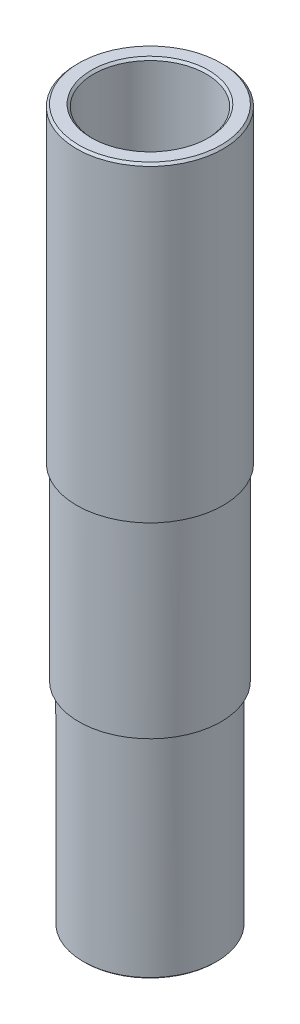
ISO-10303-21;
HEADER;
FILE_DESCRIPTION(('STEP AP214'),'2;1');
FILE_NAME('part.step','',(''),(''),'','','');
FILE_SCHEMA(('AUTOMOTIVE_DESIGN { 1 0 10303 214 1 1 1 1 }'));
ENDSEC;
DATA;
#1=APPLICATION_CONTEXT('core data for automotive mechanical design processes');
#2=APPLICATION_PROTOCOL_DEFINITION('international standard','automotive_design',2000,#1);
#3=PRODUCT_CONTEXT('',#1,'mechanical');
#4=PRODUCT('Part','Part','',(#3));
#5=PRODUCT_RELATED_PRODUCT_CATEGORY('part','',(#4));
#6=PRODUCT_DEFINITION_FORMATION('','',#4);
#7=PRODUCT_DEFINITION_CONTEXT('part definition',#1,'design');
#8=PRODUCT_DEFINITION('design','',#6,#7);
#9=PRODUCT_DEFINITION_SHAPE('','',#8);
#10=(LENGTH_UNIT() NAMED_UNIT(*) SI_UNIT(.MILLI.,.METRE.));
#11=(NAMED_UNIT(*) PLANE_ANGLE_UNIT() SI_UNIT($,.RADIAN.));
#12=(NAMED_UNIT(*) SI_UNIT($,.STERADIAN.) SOLID_ANGLE_UNIT());
#13=UNCERTAINTY_MEASURE_WITH_UNIT(LENGTH_MEASURE(1.E-05),#10,'distance_accuracy_value','');
#14=(GEOMETRIC_REPRESENTATION_CONTEXT(3) GLOBAL_UNCERTAINTY_ASSIGNED_CONTEXT((#13)) GLOBAL_UNIT_ASSIGNED_CONTEXT((#10,
#11,#12)) REPRESENTATION_CONTEXT('',''));
#15=CARTESIAN_POINT('',(0.,0.,0.));
#16=DIRECTION('',(0.,0.,1.));
#17=DIRECTION('',(1.,0.,0.));
#18=AXIS2_PLACEMENT_3D('',#15,#16,#17);
#19=CARTESIAN_POINT('',(0.,160.,0.));
#20=DIRECTION('',(0.,-1.,0.));
#21=DIRECTION('',(0.,0.,-1.));
#22=AXIS2_PLACEMENT_3D('',#19,#20,#21);
#23=CYLINDRICAL_SURFACE('',#22,16.);
#24=CARTESIAN_POINT('',(0.,47.56,0.));
#25=DIRECTION('',(0.,-1.,0.));
#26=DIRECTION('',(0.,0.,-1.));
#27=AXIS2_PLACEMENT_3D('',#24,#25,#26);
#28=CIRCLE('',#27,16.);
#29=CARTESIAN_POINT('',(0.,47.56,-16.));
#30=VERTEX_POINT('',#29);
#31=EDGE_CURVE('E62',#30,#30,#28,.T.);
#32=ORIENTED_EDGE('',*,*,#31,.F.);
#33=EDGE_LOOP('',(#32));
#34=FACE_BOUND('',#33,.T.);
#35=CARTESIAN_POINT('',(0.,90.,0.));
#36=DIRECTION('',(0.,1.,0.));
#37=DIRECTION('',(0.,0.,1.));
#38=AXIS2_PLACEMENT_3D('',#35,#36,#37);
#39=CIRCLE('',#38,16.);
#40=CARTESIAN_POINT('',(0.,90.,16.));
#41=VERTEX_POINT('',#40);
#42=EDGE_CURVE('E54',#41,#41,#39,.T.);
#43=ORIENTED_EDGE('',*,*,#42,.F.);
#44=EDGE_LOOP('',(#43));
#45=FACE_BOUND('',#44,.T.);
#46=ADVANCED_FACE('F33',(#34,#45),#23,.T.);
#47=CARTESIAN_POINT('',(0.,0.,0.));
#48=DIRECTION('',(0.,1.,0.));
#49=DIRECTION('',(0.,0.,1.));
#50=AXIS2_PLACEMENT_3D('',#47,#48,#49);
#51=PLANE('',#50);
#52=CARTESIAN_POINT('',(0.,0.,0.));
#53=DIRECTION('',(0.,1.,0.));
#54=DIRECTION('',(0.,0.,1.));
#55=AXIS2_PLACEMENT_3D('',#52,#53,#54);
#56=CIRCLE('',#55,14.7);
#57=CARTESIAN_POINT('',(0.,0.,14.7));
#58=VERTEX_POINT('',#57);
#59=EDGE_CURVE('E58',#58,#58,#56,.F.);
#60=ORIENTED_EDGE('',*,*,#59,.T.);
#61=EDGE_LOOP('',(#60));
#62=FACE_BOUND('',#61,.T.);
#63=CARTESIAN_POINT('',(0.,0.,0.));
#64=DIRECTION('',(0.,1.,0.));
#65=DIRECTION('',(0.,0.,1.));
#66=AXIS2_PLACEMENT_3D('',#63,#64,#65);
#67=CIRCLE('',#66,13.);
#68=CARTESIAN_POINT('',(0.,0.,13.));
#69=VERTEX_POINT('',#68);
#70=EDGE_CURVE('E61',#69,#69,#67,.T.);
#71=ORIENTED_EDGE('',*,*,#70,.T.);
#72=EDGE_LOOP('',(#71));
#73=FACE_BOUND('',#72,.T.);
#74=ADVANCED_FACE('F89',(#62,#73),#51,.F.);
#75=CARTESIAN_POINT('',(0.,160.,0.));
#76=DIRECTION('',(0.,-1.,0.));
#77=DIRECTION('',(0.,0.,-1.));
#78=AXIS2_PLACEMENT_3D('',#75,#76,#77);
#79=CYLINDRICAL_SURFACE('',#78,12.7);
#80=CARTESIAN_POINT('',(0.,159.5,0.));
#81=DIRECTION('',(0.,1.,0.));
#82=DIRECTION('',(0.,0.,1.));
#83=AXIS2_PLACEMENT_3D('',#80,#81,#82);
#84=CIRCLE('',#83,12.7);
#85=CARTESIAN_POINT('',(0.,159.5,12.7));
#86=VERTEX_POINT('',#85);
#87=EDGE_CURVE('E10',#86,#86,#84,.T.);
#88=ORIENTED_EDGE('',*,*,#87,.T.);
#89=EDGE_LOOP('',(#88));
#90=FACE_BOUND('',#89,.T.);
#91=CARTESIAN_POINT('',(0.,0.299999999999995,0.));
#92=DIRECTION('',(0.,1.,0.));
#93=DIRECTION('',(0.,0.,1.));
#94=AXIS2_PLACEMENT_3D('',#91,#92,#93);
#95=CIRCLE('',#94,12.7);
#96=CARTESIAN_POINT('',(0.,0.299999999999995,12.7));
#97=VERTEX_POINT('',#96);
#98=EDGE_CURVE('E65',#97,#97,#95,.F.);
#99=ORIENTED_EDGE('',*,*,#98,.T.);
#100=EDGE_LOOP('',(#99));
#101=FACE_BOUND('',#100,.T.);
#102=ADVANCED_FACE('F95',(#90,#101),#79,.F.);
#103=CARTESIAN_POINT('',(0.,0.,0.));
#104=DIRECTION('',(0.,-1.,0.));
#105=DIRECTION('',(0.,0.,-1.));
#106=AXIS2_PLACEMENT_3D('',#103,#104,#105);
#107=CONICAL_SURFACE('',#106,13.,0.785398163397451);
#108=ORIENTED_EDGE('',*,*,#98,.F.);
#109=EDGE_LOOP('',(#108));
#110=FACE_BOUND('',#109,.T.);
#111=ORIENTED_EDGE('',*,*,#70,.F.);
#112=EDGE_LOOP('',(#111));
#113=FACE_BOUND('',#112,.T.);
#114=ADVANCED_FACE('F101',(#110,#113),#107,.F.);
#115=CARTESIAN_POINT('',(0.,47.56,0.));
#116=DIRECTION('',(0.,-1.,0.));
#117=DIRECTION('',(0.,0.,-1.));
#118=AXIS2_PLACEMENT_3D('',#115,#116,#117);
#119=PLANE('',#118);
#120=CARTESIAN_POINT('',(0.,47.56,0.));
#121=DIRECTION('',(0.,-1.,0.));
#122=DIRECTION('',(0.,0.,-1.));
#123=AXIS2_PLACEMENT_3D('',#120,#121,#122);
#124=CIRCLE('',#123,15.);
#125=CARTESIAN_POINT('',(0.,47.56,-15.));
#126=VERTEX_POINT('',#125);
#127=EDGE_CURVE('E66',#126,#126,#124,.T.);
#128=ORIENTED_EDGE('',*,*,#127,.F.);
#129=EDGE_LOOP('',(#128));
#130=FACE_BOUND('',#129,.T.);
#131=ORIENTED_EDGE('',*,*,#31,.T.);
#132=EDGE_LOOP('',(#131));
#133=FACE_BOUND('',#132,.T.);
#134=ADVANCED_FACE('F104',(#130,#133),#119,.T.);
#135=CARTESIAN_POINT('',(0.,47.56,0.));
#136=DIRECTION('',(0.,-1.,0.));
#137=DIRECTION('',(0.,0.,-1.));
#138=AXIS2_PLACEMENT_3D('',#135,#136,#137);
#139=CYLINDRICAL_SURFACE('',#138,15.);
#140=CARTESIAN_POINT('',(0.,0.299999999999967,0.));
#141=DIRECTION('',(0.,1.,0.));
#142=DIRECTION('',(0.,0.,1.));
#143=AXIS2_PLACEMENT_3D('',#140,#141,#142);
#144=CIRCLE('',#143,15.);
#145=CARTESIAN_POINT('',(0.,0.299999999999967,15.));
#146=VERTEX_POINT('',#145);
#147=EDGE_CURVE('E55',#146,#146,#144,.T.);
#148=ORIENTED_EDGE('',*,*,#147,.T.);
#149=EDGE_LOOP('',(#148));
#150=FACE_BOUND('',#149,.T.);
#151=ORIENTED_EDGE('',*,*,#127,.T.);
#152=EDGE_LOOP('',(#151));
#153=FACE_BOUND('',#152,.T.);
#154=ADVANCED_FACE('F108',(#150,#153),#139,.T.);
#155=CARTESIAN_POINT('',(0.,0.,0.));
#156=DIRECTION('',(0.,1.,0.));
#157=DIRECTION('',(0.,0.,1.));
#158=AXIS2_PLACEMENT_3D('',#155,#156,#157);
#159=CONICAL_SURFACE('',#158,14.7,0.785398163397448);
#160=ORIENTED_EDGE('',*,*,#147,.F.);
#161=EDGE_LOOP('',(#160));
#162=FACE_BOUND('',#161,.T.);
#163=ORIENTED_EDGE('',*,*,#59,.F.);
#164=EDGE_LOOP('',(#163));
#165=FACE_BOUND('',#164,.T.);
#166=ADVANCED_FACE('F106',(#162,#165),#159,.T.);
#167=CARTESIAN_POINT('',(0.,160.,0.));
#168=DIRECTION('',(0.,1.,0.));
#169=DIRECTION('',(0.,0.,1.));
#170=AXIS2_PLACEMENT_3D('',#167,#168,#169);
#171=PLANE('',#170);
#172=CARTESIAN_POINT('',(0.,160.,0.));
#173=DIRECTION('',(0.,1.,0.));
#174=DIRECTION('',(0.,0.,1.));
#175=AXIS2_PLACEMENT_3D('',#172,#173,#174);
#176=CIRCLE('',#175,16.);
#177=CARTESIAN_POINT('',(0.,160.,16.));
#178=VERTEX_POINT('',#177);
#179=EDGE_CURVE('E45',#178,#178,#176,.T.);
#180=ORIENTED_EDGE('',*,*,#179,.T.);
#181=EDGE_LOOP('',(#180));
#182=FACE_BOUND('',#181,.T.);
#183=CARTESIAN_POINT('',(0.,160.,0.));
#184=DIRECTION('',(0.,1.,0.));
#185=DIRECTION('',(0.,0.,1.));
#186=AXIS2_PLACEMENT_3D('',#183,#184,#185);
#187=CIRCLE('',#186,13.2);
#188=CARTESIAN_POINT('',(0.,160.,13.2));
#189=VERTEX_POINT('',#188);
#190=EDGE_CURVE('E49',#189,#189,#187,.F.);
#191=ORIENTED_EDGE('',*,*,#190,.T.);
#192=EDGE_LOOP('',(#191));
#193=FACE_BOUND('',#192,.T.);
#194=ADVANCED_FACE('F84',(#182,#193),#171,.T.);
#195=CARTESIAN_POINT('',(0.,90.,0.));
#196=DIRECTION('',(0.,1.,0.));
#197=DIRECTION('',(0.,0.,1.));
#198=AXIS2_PLACEMENT_3D('',#195,#196,#197);
#199=PLANE('',#198);
#200=CARTESIAN_POINT('',(0.,90.,0.));
#201=DIRECTION('',(0.,1.,0.));
#202=DIRECTION('',(0.,0.,1.));
#203=AXIS2_PLACEMENT_3D('',#200,#201,#202);
#204=CIRCLE('',#203,16.5);
#205=CARTESIAN_POINT('',(0.,90.,16.5));
#206=VERTEX_POINT('',#205);
#207=EDGE_CURVE('E73',#206,#206,#204,.T.);
#208=ORIENTED_EDGE('',*,*,#207,.F.);
#209=EDGE_LOOP('',(#208));
#210=FACE_BOUND('',#209,.T.);
#211=ORIENTED_EDGE('',*,*,#42,.T.);
#212=EDGE_LOOP('',(#211));
#213=FACE_BOUND('',#212,.T.);
#214=ADVANCED_FACE('F81',(#210,#213),#199,.F.);
#215=CARTESIAN_POINT('',(0.,90.,0.));
#216=DIRECTION('',(0.,1.,0.));
#217=DIRECTION('',(0.,0.,1.));
#218=AXIS2_PLACEMENT_3D('',#215,#216,#217);
#219=CYLINDRICAL_SURFACE('',#218,16.5);
#220=CARTESIAN_POINT('',(0.,159.5,0.));
#221=DIRECTION('',(0.,1.,0.));
#222=DIRECTION('',(0.,0.,1.));
#223=AXIS2_PLACEMENT_3D('',#220,#221,#222);
#224=CIRCLE('',#223,16.5);
#225=CARTESIAN_POINT('',(0.,159.5,16.5));
#226=VERTEX_POINT('',#225);
#227=EDGE_CURVE('E41',#226,#226,#224,.F.);
#228=ORIENTED_EDGE('',*,*,#227,.T.);
#229=EDGE_LOOP('',(#228));
#230=FACE_BOUND('',#229,.T.);
#231=ORIENTED_EDGE('',*,*,#207,.T.);
#232=EDGE_LOOP('',(#231));
#233=FACE_BOUND('',#232,.T.);
#234=ADVANCED_FACE('F79',(#230,#233),#219,.T.);
#235=CARTESIAN_POINT('',(0.,160.,0.));
#236=DIRECTION('',(0.,-1.,0.));
#237=DIRECTION('',(0.,0.,-1.));
#238=AXIS2_PLACEMENT_3D('',#235,#236,#237);
#239=CONICAL_SURFACE('',#238,16.,0.785398163397421);
#240=ORIENTED_EDGE('',*,*,#227,.F.);
#241=EDGE_LOOP('',(#240));
#242=FACE_BOUND('',#241,.T.);
#243=ORIENTED_EDGE('',*,*,#179,.F.);
#244=EDGE_LOOP('',(#243));
#245=FACE_BOUND('',#244,.T.);
#246=ADVANCED_FACE('F111',(#242,#245),#239,.T.);
#247=CARTESIAN_POINT('',(0.,159.5,0.));
#248=DIRECTION('',(0.,1.,0.));
#249=DIRECTION('',(0.,0.,1.));
#250=AXIS2_PLACEMENT_3D('',#247,#248,#249);
#251=CONICAL_SURFACE('',#250,12.7,0.785398163397466);
#252=ORIENTED_EDGE('',*,*,#190,.F.);
#253=EDGE_LOOP('',(#252));
#254=FACE_BOUND('',#253,.T.);
#255=ORIENTED_EDGE('',*,*,#87,.F.);
#256=EDGE_LOOP('',(#255));
#257=FACE_BOUND('',#256,.T.);
#258=ADVANCED_FACE('F36',(#254,#257),#251,.F.);
#259=CLOSED_SHELL('',(#46,#74,#102,#114,#134,#154,#166,#194,#214,#234,#246,#258));
#260=MANIFOLD_SOLID_BREP('B2',#259);
#261=ADVANCED_BREP_SHAPE_REPRESENTATION('',(#18,#260),#14);
#262=SHAPE_DEFINITION_REPRESENTATION(#9,#261);
ENDSEC;
END-ISO-10303-21;
